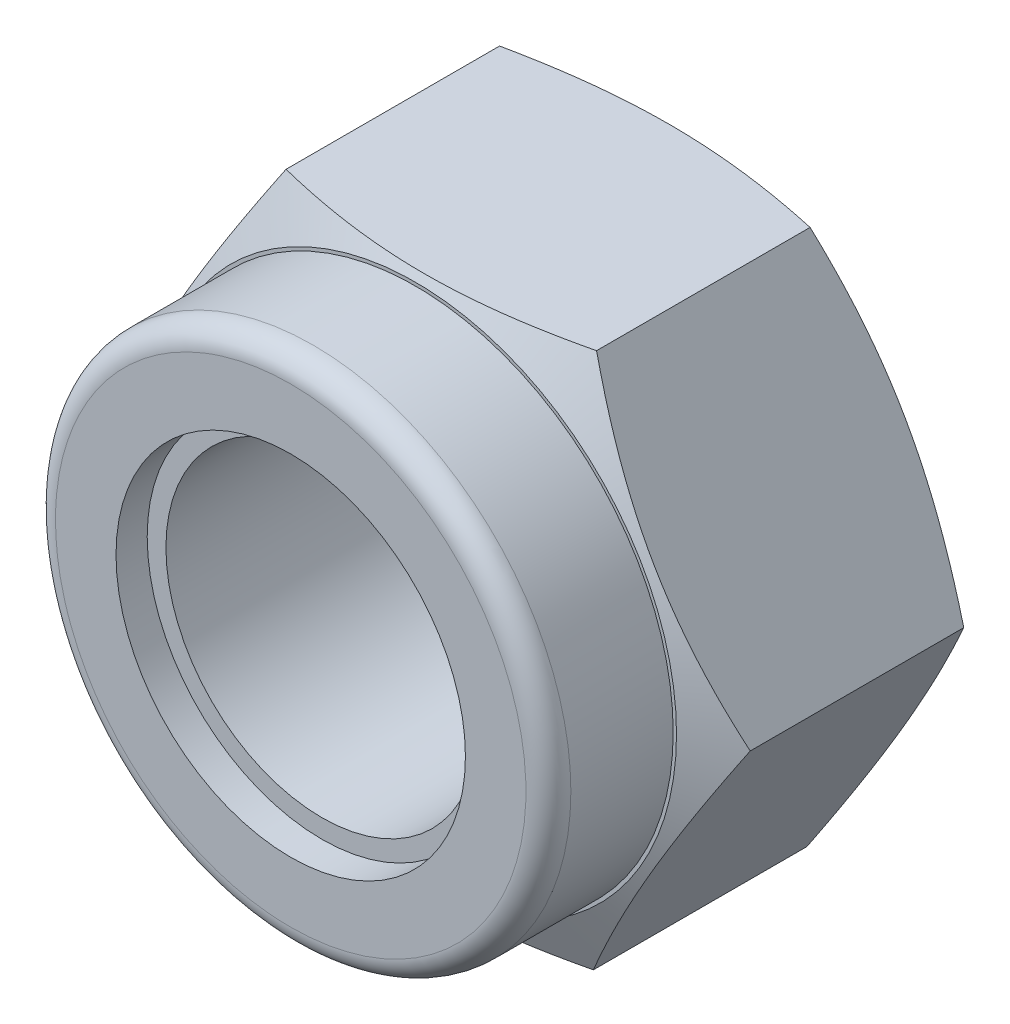
ISO-10303-21;
HEADER;
FILE_DESCRIPTION(('STEP AP214'),'2;1');
FILE_NAME('part.step','',(''),(''),'','','');
FILE_SCHEMA(('AUTOMOTIVE_DESIGN { 1 0 10303 214 1 1 1 1 }'));
ENDSEC;
DATA;
#1=APPLICATION_CONTEXT('core data for automotive mechanical design processes');
#2=APPLICATION_PROTOCOL_DEFINITION('international standard','automotive_design',2000,#1);
#3=PRODUCT_CONTEXT('',#1,'mechanical');
#4=PRODUCT('Part','Part','',(#3));
#5=PRODUCT_RELATED_PRODUCT_CATEGORY('part','',(#4));
#6=PRODUCT_DEFINITION_FORMATION('','',#4);
#7=PRODUCT_DEFINITION_CONTEXT('part definition',#1,'design');
#8=PRODUCT_DEFINITION('design','',#6,#7);
#9=PRODUCT_DEFINITION_SHAPE('','',#8);
#10=(LENGTH_UNIT() NAMED_UNIT(*) SI_UNIT(.MILLI.,.METRE.));
#11=(NAMED_UNIT(*) PLANE_ANGLE_UNIT() SI_UNIT($,.RADIAN.));
#12=(NAMED_UNIT(*) SI_UNIT($,.STERADIAN.) SOLID_ANGLE_UNIT());
#13=UNCERTAINTY_MEASURE_WITH_UNIT(LENGTH_MEASURE(1.E-05),#10,'distance_accuracy_value','');
#14=(GEOMETRIC_REPRESENTATION_CONTEXT(3) GLOBAL_UNCERTAINTY_ASSIGNED_CONTEXT((#13)) GLOBAL_UNIT_ASSIGNED_CONTEXT((#10,
#11,#12)) REPRESENTATION_CONTEXT('',''));
#15=CARTESIAN_POINT('',(0.,0.,0.));
#16=DIRECTION('',(0.,0.,1.));
#17=DIRECTION('',(1.,0.,0.));
#18=AXIS2_PLACEMENT_3D('',#15,#16,#17);
#19=CARTESIAN_POINT('',(0.,0.,5.334));
#20=DIRECTION('',(0.,0.,1.));
#21=DIRECTION('',(1.,0.,0.));
#22=AXIS2_PLACEMENT_3D('',#19,#20,#21);
#23=PLANE('',#22);
#24=CARTESIAN_POINT('',(0.,0.,5.33400000000736));
#25=DIRECTION('',(0.,0.,-1.));
#26=DIRECTION('',(-1.,0.,0.));
#27=AXIS2_PLACEMENT_3D('',#24,#25,#26);
#28=CIRCLE('',#27,5.31273775635555);
#29=CARTESIAN_POINT('',(-5.31273775635555,0.,5.33400000000736));
#30=VERTEX_POINT('',#29);
#31=EDGE_CURVE('E281',#30,#30,#28,.T.);
#32=ORIENTED_EDGE('',*,*,#31,.F.);
#33=EDGE_LOOP('',(#32));
#34=FACE_BOUND('',#33,.T.);
#35=CARTESIAN_POINT('',(0.,0.,5.334));
#36=DIRECTION('',(0.,0.,1.));
#37=DIRECTION('',(1.,0.,0.));
#38=AXIS2_PLACEMENT_3D('',#35,#36,#37);
#39=CIRCLE('',#38,5.2451);
#40=CARTESIAN_POINT('',(5.2451,0.,5.334));
#41=VERTEX_POINT('',#40);
#42=EDGE_CURVE('E20',#41,#41,#39,.T.);
#43=ORIENTED_EDGE('',*,*,#42,.F.);
#44=EDGE_LOOP('',(#43));
#45=FACE_BOUND('',#44,.T.);
#46=ADVANCED_FACE('F16',(#34,#45),#23,.T.);
#47=CARTESIAN_POINT('',(0.,0.,5.334));
#48=DIRECTION('',(0.,0.,1.));
#49=DIRECTION('',(1.,0.,0.));
#50=AXIS2_PLACEMENT_3D('',#47,#48,#49);
#51=CYLINDRICAL_SURFACE('',#50,5.2451);
#52=ORIENTED_EDGE('',*,*,#42,.T.);
#53=EDGE_LOOP('',(#52));
#54=FACE_BOUND('',#53,.T.);
#55=CARTESIAN_POINT('',(0.,0.,7.4168));
#56=DIRECTION('',(0.,0.,1.));
#57=DIRECTION('',(1.,0.,0.));
#58=AXIS2_PLACEMENT_3D('',#55,#56,#57);
#59=CIRCLE('',#58,5.2451);
#60=CARTESIAN_POINT('',(5.2451,0.,7.4168));
#61=VERTEX_POINT('',#60);
#62=EDGE_CURVE('E85',#61,#61,#59,.T.);
#63=ORIENTED_EDGE('',*,*,#62,.F.);
#64=EDGE_LOOP('',(#63));
#65=FACE_BOUND('',#64,.T.);
#66=ADVANCED_FACE('F118',(#54,#65),#51,.T.);
#67=CARTESIAN_POINT('',(0.,0.,4.83836780344404));
#68=DIRECTION('',(0.,0.,-1.));
#69=DIRECTION('',(-1.,0.,0.));
#70=AXIS2_PLACEMENT_3D('',#67,#68,#69);
#71=CONICAL_SURFACE('',#70,6.3265308160112,1.11607702485432);
#72=CARTESIAN_POINT('',(6.32037506594794,-0.0371655629206129,4.84132386008899));
#73=CARTESIAN_POINT('',(6.22833366151809,-0.19444286281713,4.8858660135372));
#74=CARTESIAN_POINT('',(6.13593989417938,-0.352322268768321,4.92769627799901));
#75=CARTESIAN_POINT('',(5.95043037166558,-0.669314789545201,5.00501655106751));
#76=CARTESIAN_POINT('',(5.85731426499188,-0.828428505000025,5.04050324073664));
#77=CARTESIAN_POINT('',(5.67031652629657,-1.14796404024023,5.10421314817306));
#78=CARTESIAN_POINT('',(5.57643405141017,-1.30838730028498,5.1324267923882));
#79=CARTESIAN_POINT('',(5.38814286869859,-1.63013302977098,5.18062149325364));
#80=CARTESIAN_POINT('',(5.29373425705883,-1.79145533485376,5.20060400767163));
#81=CARTESIAN_POINT('',(5.10662322282933,-2.11118446574603,5.23126731054475));
#82=CARTESIAN_POINT('',(5.01392905247022,-2.26957719041745,5.24214339050006));
#83=CARTESIAN_POINT('',(4.82837594477426,-2.58664418810835,5.25490604687276));
#84=CARTESIAN_POINT('',(4.73551699905818,-2.74531847544599,5.25679215221227));
#85=CARTESIAN_POINT('',(4.54996186341723,-3.06238893842205,5.25150045578435));
#86=CARTESIAN_POINT('',(4.4572656043928,-3.2207852321355,5.24433199570822));
#87=CARTESIAN_POINT('',(4.27216288236742,-3.53708262572682,5.22123078858181));
#88=CARTESIAN_POINT('',(4.17975639476994,-3.69498376763441,5.20529880682979));
#89=CARTESIAN_POINT('',(4.00714250371091,-3.98994066098654,5.16780955551947));
#90=CARTESIAN_POINT('',(3.92688014289494,-4.12709032173596,5.14722700506324));
#91=CARTESIAN_POINT('',(3.76677978044193,-4.40066451234116,5.10035283174324));
#92=CARTESIAN_POINT('',(3.68694180089308,-4.53708900445337,5.0740609146422));
#93=CARTESIAN_POINT('',(3.5269404443261,-4.81049401708344,5.01605322972002));
#94=CARTESIAN_POINT('',(3.44678193376816,-4.94746622195552,4.9842853299852));
#95=CARTESIAN_POINT('',(3.28699660715654,-5.22050208976119,4.91612438552128));
#96=CARTESIAN_POINT('',(3.20736961164292,-5.35656605935,4.87973299465746));
#97=CARTESIAN_POINT('',(3.12800121134054,-5.49218815001656,4.84132386008874));
#98=B_SPLINE_CURVE_WITH_KNOTS('',3,(#72,#73,#74,#75,#76,#77,#78,#79,#80,#81,#82,#83,#84,#85,#86,
#87,#88,#89,#90,#91,#92,#93,#94,#95,#96,#97),.UNSPECIFIED.,.F.,.F.,(4,2,2,2,2,2,2,2,2,2,2,2,4),
(0.,0.562813868194877,1.12592134237628,1.68976629638556,2.2535113481042,2.80483224896724,
3.35618203892448,3.90696345979255,4.45769678981567,4.93829687717906,5.41892173857439,
5.90440415872453,6.38971340373801),.UNSPECIFIED.);
#99=CARTESIAN_POINT('',(6.3203750659453,-0.0371655629146358,4.8413238600903));
#100=VERTEX_POINT('',#99);
#101=CARTESIAN_POINT('',(3.12800122281629,-5.49218815008425,4.84132385728342));
#102=VERTEX_POINT('',#101);
#103=EDGE_CURVE('E73',#100,#102,#98,.T.);
#104=ORIENTED_EDGE('',*,*,#103,.F.);
#105=CARTESIAN_POINT('',(3.19237385460845,5.45502258709762,4.84132386008864));
#106=CARTESIAN_POINT('',(3.28208512918141,5.29750628008782,4.88563179788484));
#107=CARTESIAN_POINT('',(3.37213784296513,5.13939046935004,4.92725624998518));
#108=CARTESIAN_POINT('',(3.55294266570987,4.82193084006841,5.00423596484944));
#109=CARTESIAN_POINT('',(3.64369510847837,4.66258643542072,5.0395880139036));
#110=CARTESIAN_POINT('',(3.8259485291596,4.34258333768004,5.10311689041716));
#111=CARTESIAN_POINT('',(3.91745035997898,4.18192314704165,5.13128385422299));
#112=CARTESIAN_POINT('',(4.1009666015464,3.85970277077768,5.17948424190754));
#113=CARTESIAN_POINT('',(4.19298092192724,3.69814274382008,5.19951905640176));
#114=CARTESIAN_POINT('',(4.3763064177163,3.3762572816539,5.23055252558859));
#115=CARTESIAN_POINT('',(4.46761329058068,3.21593940091178,5.24165376667182));
#116=CARTESIAN_POINT('',(4.65039373436749,2.89501094865245,5.25477402327016));
#117=CARTESIAN_POINT('',(4.74186731391235,2.73440036199585,5.25679255485539));
#118=CARTESIAN_POINT('',(4.92465602509764,2.41345739372297,5.25166678488675));
#119=CARTESIAN_POINT('',(5.01597122281918,2.25312489608054,5.24453194191376));
#120=CARTESIAN_POINT('',(5.19831553759308,1.93296220522435,5.2214010893566));
#121=CARTESIAN_POINT('',(5.2893446796386,1.77313196812721,5.20540587686116));
#122=CARTESIAN_POINT('',(5.45755507746106,1.47778580576614,5.16812128791714));
#123=CARTESIAN_POINT('',(5.53479875100708,1.34216028651277,5.14796055986878));
#124=CARTESIAN_POINT('',(5.68888070460646,1.07162104355403,5.10212452056477));
#125=CARTESIAN_POINT('',(5.76571899315048,0.936707304940669,5.07644932528127));
#126=CARTESIAN_POINT('',(5.91894129525481,0.667677450065663,5.02012897810935));
#127=CARTESIAN_POINT('',(5.99532532753603,0.533561300933592,4.98948403252753));
#128=CARTESIAN_POINT('',(6.14762095713527,0.266158510566403,4.9237807036753));
#129=CARTESIAN_POINT('',(6.22353258486393,0.13287181593588,4.88872260764732));
#130=CARTESIAN_POINT('',(6.30626569398043,-0.0123921308479018,4.84827518686258));
#131=CARTESIAN_POINT('',(6.31332140864244,-0.0247806530505442,4.84480784669621));
#132=CARTESIAN_POINT('',(6.32037506594266,-0.0371655629086588,4.84132386009161));
#133=B_SPLINE_CURVE_WITH_KNOTS('',3,(#105,#106,#107,#108,#109,#110,#111,#112,#113,#114,#115,
#116,#117,#118,#119,#120,#121,#122,#123,#124,#125,#126,#127,#128,#129,#130,#131,#132),
.UNSPECIFIED.,.F.,.F.,(4,2,2,2,2,2,2,2,2,2,2,2,2,4),(0.,0.55985412939021,1.11999428081796,
1.68089930141867,2.24170836557184,2.79598175912566,3.35028468420697,3.90401528500992,
4.45769607967872,4.92972204239881,5.4017380791355,5.87373452633379,6.34570026817044,
6.38971758818025),.UNSPECIFIED.);
#134=CARTESIAN_POINT('',(3.19237385707062,5.45502258277493,4.8413238613046));
#135=VERTEX_POINT('',#134);
#136=EDGE_CURVE('E126',#135,#100,#133,.T.);
#137=ORIENTED_EDGE('',*,*,#136,.F.);
#138=CARTESIAN_POINT('',(-3.12800121134198,5.49218815001699,4.84132386008821));
#139=CARTESIAN_POINT('',(-2.94577437197797,5.49111660552899,4.88586601353647));
#140=CARTESIAN_POINT('',(-2.76284991202042,5.49004095883792,4.92769627799833));
#141=CARTESIAN_POINT('',(-2.39557157496093,5.48788126008548,5.00501655106693));
#142=CARTESIAN_POINT('',(-2.21121700194961,5.48679720393198,5.04050324073611));
#143=CARTESIAN_POINT('',(-1.84099224167192,5.48462017939169,5.10421314817263));
#144=CARTESIAN_POINT('',(-1.65512038567198,5.48352720119229,5.13242679238782));
#145=CARTESIAN_POINT('',(-1.28233481902201,5.48133511839845,5.18062149325336));
#146=CARTESIAN_POINT('',(-1.09542129880329,5.48023601492378,5.2006040076714));
#147=CARTESIAN_POINT('',(-0.724972232005771,5.47805767139879,5.2312673105446));
#148=CARTESIAN_POINT('',(-0.541453023486053,5.47697852742078,5.24214339049995));
#149=CARTESIAN_POINT('',(-0.174088394935942,5.47481832125039,5.25490604687272));
#150=CARTESIAN_POINT('',(0.00975704168396752,5.47373725896044,5.25679215221226));
#151=CARTESIAN_POINT('',(0.37712568523155,5.47157702918074,5.25150045578441));
#152=CARTESIAN_POINT('',(0.560649028964985,5.47049786088653,5.2443319957083));
#153=CARTESIAN_POINT('',(0.927121967978725,5.46834289809856,5.22123078858194));
#154=CARTESIAN_POINT('',(1.11007161195609,5.46726710331844,5.20529880682994));
#155=CARTESIAN_POINT('',(1.45181872015016,5.4652575352913,5.16780955551962));
#156=CARTESIAN_POINT('',(1.61072499088775,5.46432312223167,5.14722700506338));
#157=CARTESIAN_POINT('',(1.92769737099852,5.46245923649487,5.10035283174334));
#158=CARTESIAN_POINT('',(2.08576343664071,5.46152976407484,5.07406091464228));
#159=CARTESIAN_POINT('',(2.40253980138424,5.4596670309629,5.01605322972003));
#160=CARTESIAN_POINT('',(2.56124046569499,5.45873382692624,4.98428532998516));
#161=CARTESIAN_POINT('',(2.87758912666524,5.45687360883142,4.91612438552116));
#162=CARTESIAN_POINT('',(3.0352374786259,5.45594659268399,4.87973299465728));
#163=CARTESIAN_POINT('',(3.19237385460888,5.45502258709768,4.8413238600885));
#164=B_SPLINE_CURVE_WITH_KNOTS('',3,(#138,#139,#140,#141,#142,#143,#144,#145,#146,#147,#148,
#149,#150,#151,#152,#153,#154,#155,#156,#157,#158,#159,#160,#161,#162,#163),.UNSPECIFIED.,.F.,
.F.,(4,2,2,2,2,2,2,2,2,2,2,2,4),(0.,0.56281386819512,1.12592134237677,1.68976629638629,
2.25351134810518,2.80483224896845,3.35618203892592,3.90696345979422,4.45769678981757,
4.93829687718154,5.41892173857746,5.90440415872821,6.3897134037423),.UNSPECIFIED.);
#165=CARTESIAN_POINT('',(-3.12800122281598,5.49218815008425,4.84132385728349));
#166=VERTEX_POINT('',#165);
#167=EDGE_CURVE('E133',#166,#135,#164,.T.);
#168=ORIENTED_EDGE('',*,*,#167,.F.);
#169=CARTESIAN_POINT('',(-6.32037506594956,0.0371655629178402,4.84132386008821));
#170=CARTESIAN_POINT('',(-6.22833366151967,0.194442862814418,4.88586601353647));
#171=CARTESIAN_POINT('',(-6.13593989418093,0.352322268765671,4.92769627799833));
#172=CARTESIAN_POINT('',(-5.95043037166705,0.669314789542675,5.00501655106693));
#173=CARTESIAN_POINT('',(-5.85731426499332,0.828428504997562,5.04050324073611));
#174=CARTESIAN_POINT('',(-5.67031652629793,1.1479640402379,5.10421314817263));
#175=CARTESIAN_POINT('',(-5.5764340514115,1.30838730028271,5.13242679238782));
#176=CARTESIAN_POINT('',(-5.38814286869984,1.63013302976884,5.18062149325336));
#177=CARTESIAN_POINT('',(-5.29373425706004,1.79145533485169,5.2006040076714));
#178=CARTESIAN_POINT('',(-5.10662322283046,2.11118446574409,5.2312673105446));
#179=CARTESIAN_POINT('',(-5.01392905247131,2.26957719041558,5.24214339049995));
#180=CARTESIAN_POINT('',(-4.82837594477528,2.58664418810661,5.25490604687272));
#181=CARTESIAN_POINT('',(-4.73551699905915,2.74531847544432,5.25679215221226));
#182=CARTESIAN_POINT('',(-4.54996186341813,3.0623889384205,5.25150045578441));
#183=CARTESIAN_POINT('',(-4.45726560439367,3.22078523213402,5.2443319957083));
#184=CARTESIAN_POINT('',(-4.27216288236821,3.53708262572548,5.22123078858194));
#185=CARTESIAN_POINT('',(-4.17975639477069,3.69498376763314,5.20529880682994));
#186=CARTESIAN_POINT('',(-4.00714250371156,3.98994066098543,5.16780955551963));
#187=CARTESIAN_POINT('',(-3.92688014289553,4.12709032173495,5.1472270050634));
#188=CARTESIAN_POINT('',(-3.7667797804424,4.40066451234036,5.10035283174339));
#189=CARTESIAN_POINT('',(-3.68694180089349,4.53708900445266,5.07406091464234));
#190=CARTESIAN_POINT('',(-3.5269404443264,4.81049401708294,5.01605322972014));
#191=CARTESIAN_POINT('',(-3.44678193376839,4.94746622195512,4.98428532998529));
#192=CARTESIAN_POINT('',(-3.28699660715666,5.22050208976099,4.91612438552134));
#193=CARTESIAN_POINT('',(-3.20736961164298,5.3565660593499,4.87973299465749));
#194=CARTESIAN_POINT('',(-3.12800121134054,5.49218815001656,4.84132386008874));
#195=B_SPLINE_CURVE_WITH_KNOTS('',3,(#169,#170,#171,#172,#173,#174,#175,#176,#177,#178,#179,
#180,#181,#182,#183,#184,#185,#186,#187,#188,#189,#190,#191,#192,#193,#194),.UNSPECIFIED.,.F.,
.F.,(4,2,2,2,2,2,2,2,2,2,2,2,4),(0.,0.56281386819512,1.12592134237677,1.6897662963863,
2.25351134810518,2.80483224896845,3.35618203892592,3.90696345979422,4.45769678981757,
4.9382968771813,5.41892173857698,5.90440415872747,6.38971340374132),.UNSPECIFIED.);
#196=CARTESIAN_POINT('',(-6.32037507174721,0.0371655530104973,4.84132385728233));
#197=VERTEX_POINT('',#196);
#198=EDGE_CURVE('E140',#197,#166,#195,.T.);
#199=ORIENTED_EDGE('',*,*,#198,.F.);
#200=CARTESIAN_POINT('',(-3.19237385460758,-5.45502258709915,4.84132386008821));
#201=CARTESIAN_POINT('',(-3.28208512918056,-5.29750628008931,4.88563179788444));
#202=CARTESIAN_POINT('',(-3.3721378429643,-5.13939046935149,4.92725624998481));
#203=CARTESIAN_POINT('',(-3.55294266570909,-4.82193084006978,5.00423596484913));
#204=CARTESIAN_POINT('',(-3.64369510847761,-4.66258643542207,5.03958801390332));
#205=CARTESIAN_POINT('',(-3.82594852915888,-4.34258333768131,5.10311689041693));
#206=CARTESIAN_POINT('',(-3.91745035997828,-4.18192314704288,5.13128385422278));
#207=CARTESIAN_POINT('',(-4.10096660154574,-3.85970277077883,5.17948424190739));
#208=CARTESIAN_POINT('',(-4.19298092192661,-3.69814274382119,5.19951905640164));
#209=CARTESIAN_POINT('',(-4.3763064177157,-3.37625728165494,5.23055252558851));
#210=CARTESIAN_POINT('',(-4.4676132905801,-3.21593940091279,5.24165376667176));
#211=CARTESIAN_POINT('',(-4.65039373436695,-2.89501094865339,5.25477402327014));
#212=CARTESIAN_POINT('',(-4.74186731391183,-2.73440036199675,5.25679255485539));
#213=CARTESIAN_POINT('',(-4.92465602509716,-2.41345739372381,5.25166678488678));
#214=CARTESIAN_POINT('',(-5.01597122281873,-2.25312489608134,5.2445319419138));
#215=CARTESIAN_POINT('',(-5.19831553759266,-1.93296220522508,5.22140108935667));
#216=CARTESIAN_POINT('',(-5.28934467963821,-1.77313196812791,5.20540587686124));
#217=CARTESIAN_POINT('',(-5.45755507746104,-1.47778580576617,5.16812128791715));
#218=CARTESIAN_POINT('',(-5.53479875100741,-1.34216028651217,5.1479605598687));
#219=CARTESIAN_POINT('',(-5.68888070460751,-1.0716210435522,5.10212452056444));
#220=CARTESIAN_POINT('',(-5.76571899315188,-0.936707304938216,5.07644932528079));
#221=CARTESIAN_POINT('',(-5.91894129525691,-0.667677450061981,5.02012897810854));
#222=CARTESIAN_POINT('',(-5.99532532753847,-0.5335613009293,4.98948403252653));
#223=CARTESIAN_POINT('',(-6.14762095713841,-0.266158510560896,4.92378070367389));
#224=CARTESIAN_POINT('',(-6.2235325848674,-0.132871815929769,4.88872260764569));
#225=CARTESIAN_POINT('',(-6.3062656939849,0.0123921308557474,4.84827518686039));
#226=CARTESIAN_POINT('',(-6.31332140864756,0.0247806530595255,4.84480784669369));
#227=CARTESIAN_POINT('',(-6.32037506594842,0.0371655629187751,4.84132386008877));
#228=B_SPLINE_CURVE_WITH_KNOTS('',3,(#200,#201,#202,#203,#204,#205,#206,#207,#208,#209,#210,
#211,#212,#213,#214,#215,#216,#217,#218,#219,#220,#221,#222,#223,#224,#225,#226,#227),
.UNSPECIFIED.,.F.,.F.,(4,2,2,2,2,2,2,2,2,2,2,2,2,4),(0.,0.559854129390351,1.11999428081824,
1.6808993014191,2.24170836557241,2.79598175912635,3.35028468420777,3.90401528501084,
4.45769607967976,4.92972204240202,5.40173807914089,5.87373452634136,6.34570026818019,
6.38971758819405),.UNSPECIFIED.);
#229=CARTESIAN_POINT('',(-3.19237384892808,-5.45502259707088,4.84132385728312));
#230=VERTEX_POINT('',#229);
#231=EDGE_CURVE('E93',#230,#197,#228,.T.);
#232=ORIENTED_EDGE('',*,*,#231,.F.);
#233=CARTESIAN_POINT('',(3.12800121134198,-5.49218815001699,4.84132386008821));
#234=CARTESIAN_POINT('',(2.94577437197798,-5.491116605529,4.88586601353647));
#235=CARTESIAN_POINT('',(2.76284991202042,-5.49004095883792,4.92769627799833));
#236=CARTESIAN_POINT('',(2.39557157496093,-5.48788126008548,5.00501655106693));
#237=CARTESIAN_POINT('',(2.21121700194961,-5.48679720393198,5.04050324073611));
#238=CARTESIAN_POINT('',(1.84099224167193,-5.48462017939169,5.10421314817263));
#239=CARTESIAN_POINT('',(1.65512038567198,-5.4835272011923,5.13242679238782));
#240=CARTESIAN_POINT('',(1.28233481902201,-5.48133511839845,5.18062149325336));
#241=CARTESIAN_POINT('',(1.09542129880329,-5.48023601492378,5.20060400767139));
#242=CARTESIAN_POINT('',(0.724972232005771,-5.47805767139879,5.2312673105446));
#243=CARTESIAN_POINT('',(0.541453023486052,-5.47697852742079,5.24214339049995));
#244=CARTESIAN_POINT('',(0.17408839493594,-5.47481832125039,5.25490604687272));
#245=CARTESIAN_POINT('',(-0.0097570416839691,-5.47373725896044,5.25679215221226));
#246=CARTESIAN_POINT('',(-0.377125685231552,-5.47157702918074,5.25150045578441));
#247=CARTESIAN_POINT('',(-0.560649028964987,-5.47049786088653,5.2443319957083));
#248=CARTESIAN_POINT('',(-0.927121967978728,-5.46834289809856,5.22123078858194));
#249=CARTESIAN_POINT('',(-1.11007161195609,-5.46726710331844,5.20529880682994));
#250=CARTESIAN_POINT('',(-1.45181872015008,-5.4652575352913,5.16780955551963));
#251=CARTESIAN_POINT('',(-1.6107249908876,-5.46432312223168,5.1472270050634));
#252=CARTESIAN_POINT('',(-1.92769737099821,-5.46245923649487,5.10035283174339));
#253=CARTESIAN_POINT('',(-2.08576343664031,-5.46152976407484,5.07406091464234));
#254=CARTESIAN_POINT('',(-2.40253980138368,-5.45966703096291,5.01605322972014));
#255=CARTESIAN_POINT('',(-2.56124046569435,-5.45873382692624,4.98428532998529));
#256=CARTESIAN_POINT('',(-2.87758912666444,-5.45687360883142,4.91612438552134));
#257=CARTESIAN_POINT('',(-3.03523747862502,-5.455946592684,4.87973299465749));
#258=CARTESIAN_POINT('',(-3.19237385460793,-5.45502258709769,4.84132386008874));
#259=B_SPLINE_CURVE_WITH_KNOTS('',3,(#233,#234,#235,#236,#237,#238,#239,#240,#241,#242,#243,
#244,#245,#246,#247,#248,#249,#250,#251,#252,#253,#254,#255,#256,#257,#258),.UNSPECIFIED.,.F.,
.F.,(4,2,2,2,2,2,2,2,2,2,2,2,4),(0.,0.56281386819512,1.12592134237677,1.68976629638629,
2.25351134810518,2.80483224896845,3.35618203892592,3.90696345979422,4.45769678981757,
4.9382968771813,5.41892173857698,5.90440415872747,6.38971340374131),.UNSPECIFIED.);
#260=EDGE_CURVE('E84',#102,#230,#259,.T.);
#261=ORIENTED_EDGE('',*,*,#260,.F.);
#262=EDGE_LOOP('',(#104,#137,#168,#199,#232,#261));
#263=FACE_BOUND('',#262,.T.);
#264=ORIENTED_EDGE('',*,*,#31,.T.);
#265=EDGE_LOOP('',(#264));
#266=FACE_BOUND('',#265,.T.);
#267=ADVANCED_FACE('F95',(#263,#266),#71,.T.);
#268=CARTESIAN_POINT('',(0.,0.,7.4168));
#269=DIRECTION('',(0.,0.,-1.));
#270=DIRECTION('',(-1.,0.,0.));
#271=AXIS2_PLACEMENT_3D('',#268,#269,#270);
#272=TOROIDAL_SURFACE('',#271,4.7879,0.4572);
#273=ORIENTED_EDGE('',*,*,#62,.T.);
#274=EDGE_LOOP('',(#273));
#275=FACE_BOUND('',#274,.T.);
#276=CARTESIAN_POINT('',(0.,4.7879,7.874));
#277=CARTESIAN_POINT('',(-0.912507970637655,4.78800107826667,7.874));
#278=CARTESIAN_POINT('',(-1.7624006599113,4.45173340665681,7.874));
#279=CARTESIAN_POINT('',(-2.21282144880202,4.27352037831036,7.874));
#280=CARTESIAN_POINT('',(-2.61998557823273,4.00745080816378,7.874));
#281=CARTESIAN_POINT('',(-3.03415135893962,3.73680586850226,7.874));
#282=CARTESIAN_POINT('',(-3.38555655764307,3.38555655764307,7.874));
#283=CARTESIAN_POINT('',(-3.73546696528567,3.03580137473629,7.874));
#284=CARTESIAN_POINT('',(-4.00745080816377,2.61998557823273,7.874));
#285=CARTESIAN_POINT('',(-4.27255727958396,2.21468408162421,7.874));
#286=CARTESIAN_POINT('',(-4.4517334066568,1.7624006599113,7.874));
#287=CARTESIAN_POINT('',(-4.78770071533789,0.9143387755723,7.874));
#288=CARTESIAN_POINT('',(-4.7879,0.,7.874));
#289=CARTESIAN_POINT('',(-4.78809883178006,-0.912260905566992,7.874));
#290=CARTESIAN_POINT('',(-4.4517334066568,-1.7624006599113,7.874));
#291=CARTESIAN_POINT('',(-4.27352037830815,-2.21282144880707,7.874));
#292=CARTESIAN_POINT('',(-4.00745080816377,-2.61998557823274,7.874));
#293=CARTESIAN_POINT('',(-3.7368058684979,-3.03415135894459,7.874));
#294=CARTESIAN_POINT('',(-3.38555655764306,-3.38555655764308,7.874));
#295=CARTESIAN_POINT('',(-3.03580137473736,-3.73546696528398,7.874));
#296=CARTESIAN_POINT('',(-2.61998557823271,-4.00745080816379,7.874));
#297=CARTESIAN_POINT('',(-2.214684081631,-4.27255727958048,7.874));
#298=CARTESIAN_POINT('',(-1.76240065991129,-4.45173340665681,7.874));
#299=CARTESIAN_POINT('',(-0.914091321852844,-4.78779874634594,7.874));
#300=CARTESIAN_POINT('',(0.,-4.7879,7.874));
#301=B_SPLINE_CURVE_WITH_KNOTS('',2,(#276,#277,#278,#279,#280,#281,#282,#283,#284,#285,#286,
#287,#288,#289,#290,#291,#292,#293,#294,#295,#296,#297,#298,#299,#300),.UNSPECIFIED.,.F.,.F.,(3,
2,2,2,2,2,2,2,2,2,2,2,3),(0.,0.125,0.1875,0.25,0.3125,0.375,0.5,0.625,0.6875,0.75,0.8125,0.875,
1.),.UNSPECIFIED.);
#302=CARTESIAN_POINT('',(0.,4.7879,7.874));
#303=VERTEX_POINT('',#302);
#304=CARTESIAN_POINT('',(0.,-4.7879,7.874));
#305=VERTEX_POINT('',#304);
#306=EDGE_CURVE('E261',#303,#305,#301,.T.);
#307=ORIENTED_EDGE('',*,*,#306,.F.);
#308=CARTESIAN_POINT('',(0.,0.,7.874));
#309=DIRECTION('',(0.,0.,-1.));
#310=DIRECTION('',(-1.,0.,0.));
#311=AXIS2_PLACEMENT_3D('',#308,#309,#310);
#312=CIRCLE('',#311,4.7879);
#313=EDGE_CURVE('E262',#305,#303,#312,.F.);
#314=ORIENTED_EDGE('',*,*,#313,.F.);
#315=EDGE_LOOP('',(#307,#314));
#316=FACE_BOUND('',#315,.T.);
#317=ADVANCED_FACE('F18',(#275,#316),#272,.T.);
#318=CARTESIAN_POINT('',(6.32037506594871,-0.0371655629192953,0.));
#319=DIRECTION('',(0.863070343395602,-0.505083737959358,0.));
#320=DIRECTION('',(0.505083737959358,0.863070343395602,0.));
#321=AXIS2_PLACEMENT_3D('',#318,#319,#320);
#322=PLANE('',#321);
#323=CARTESIAN_POINT('',(6.32037502985006,-0.0371654459643939,0.49495993962358));
#324=CARTESIAN_POINT('',(6.21595254922659,-0.215599232787237,0.450368281543948));
#325=CARTESIAN_POINT('',(6.11116742702291,-0.394652622018415,0.408901016145712));
#326=CARTESIAN_POINT('',(5.90086249945405,-0.754014743171803,0.333349470541661));
#327=CARTESIAN_POINT('',(5.79534231202103,-0.934324127925177,0.299269380046743));
#328=CARTESIAN_POINT('',(5.5836463007788,-1.29606324310159,0.239671060506125));
#329=CARTESIAN_POINT('',(5.47747030068677,-1.47749327475536,0.214155245517185));
#330=CARTESIAN_POINT('',(5.26465625223767,-1.84114286653184,0.172749422188399));
#331=CARTESIAN_POINT('',(5.1580183031682,-2.02336225699609,0.156857439621324));
#332=CARTESIAN_POINT('',(4.9464654976336,-2.38485667558204,0.135632320851297));
#333=CARTESIAN_POINT('',(4.84155560760613,-2.56412321719835,0.130107740976537));
#334=CARTESIAN_POINT('',(4.6317176050926,-2.9226874380652,0.129300758661452));
#335=CARTESIAN_POINT('',(4.52678949183353,-3.10198511863662,0.13401911056459));
#336=CARTESIAN_POINT('',(4.31725526842711,-3.46003025161962,0.153463378695621));
#337=CARTESIAN_POINT('',(4.21264897279512,-3.63877802098118,0.168181601635434));
#338=CARTESIAN_POINT('',(4.00389207635088,-3.99549488348476,0.206949810762892));
#339=CARTESIAN_POINT('',(3.89974143292936,-4.1734640494361,0.230998904680507));
#340=CARTESIAN_POINT('',(3.74000861238008,-4.44641019662172,0.274420805207881));
#341=CARTESIAN_POINT('',(3.68421435964086,-4.54174956562599,0.290822311011308));
#342=CARTESIAN_POINT('',(3.57281346288463,-4.73210772407037,0.325876668715684));
#343=CARTESIAN_POINT('',(3.51720679518185,-4.82712655398393,0.344529224541546));
#344=CARTESIAN_POINT('',(3.40588754576298,-5.01734519616513,0.384021503684979));
#345=CARTESIAN_POINT('',(3.35017597495109,-5.11254328103321,0.404872337132735));
#346=CARTESIAN_POINT('',(3.23894418645349,-5.3026124728924,0.448508257005031));
#347=CARTESIAN_POINT('',(3.18342397536334,-5.39748356861324,0.471293409419105));
#348=CARTESIAN_POINT('',(3.12800127426777,-5.49218804248861,0.494959830355336));
#349=B_SPLINE_CURVE_WITH_KNOTS('',3,(#323,#324,#325,#326,#327,#328,#329,#330,#331,#332,#333,
#334,#335,#336,#337,#338,#339,#340,#341,#342,#343,#344,#345,#346,#347,#348),.UNSPECIFIED.,.F.,
.F.,(4,2,2,2,2,2,2,2,2,2,2,2,4),(0.,0.634532172801817,1.26942329071488,1.90449321868397,
2.53943282461717,3.16252769933765,3.78566846360438,4.40833036358988,5.03093273583368,
5.36594211654617,5.70090748222071,6.03765525293353,6.374414516459),.UNSPECIFIED.);
#350=CARTESIAN_POINT('',(6.32037501295764,-0.0371654698768281,0.494959834132793));
#351=VERTEX_POINT('',#350);
#352=CARTESIAN_POINT('',(3.1280012542799,-5.49218809632028,0.494959846266548));
#353=VERTEX_POINT('',#352);
#354=EDGE_CURVE('E187',#351,#353,#349,.T.);
#355=ORIENTED_EDGE('',*,*,#354,.F.);
#356=DIRECTION('',(0.,0.,1.));
#357=VECTOR('',#356,1.);
#358=CARTESIAN_POINT('',(6.32037506594758,-0.0371655629173,0.));
#359=LINE('',#358,#357);
#360=EDGE_CURVE('E80',#100,#351,#359,.F.);
#361=ORIENTED_EDGE('',*,*,#360,.F.);
#362=ORIENTED_EDGE('',*,*,#103,.T.);
#363=DIRECTION('',(0.,0.,1.));
#364=VECTOR('',#363,1.);
#365=CARTESIAN_POINT('',(3.12800123429203,-5.49218815015194,0.));
#366=LINE('',#365,#364);
#367=EDGE_CURVE('E77',#353,#102,#366,.T.);
#368=ORIENTED_EDGE('',*,*,#367,.F.);
#369=EDGE_LOOP('',(#355,#361,#362,#368));
#370=FACE_BOUND('',#369,.T.);
#371=ADVANCED_FACE('F76',(#370),#322,.T.);
#372=CARTESIAN_POINT('',(3.1280012113403,-5.49218815001698,0.));
#373=DIRECTION('',(-0.00588017641340522,-0.999982711613229,0.));
#374=DIRECTION('',(0.999982711613229,-0.00588017641340522,0.));
#375=AXIS2_PLACEMENT_3D('',#372,#373,#374);
#376=PLANE('',#375);
#377=CARTESIAN_POINT('',(3.12800126410636,-5.49218810135755,0.494959903583258));
#378=CARTESIAN_POINT('',(2.92126182811703,-5.49097244736428,0.450368264032376));
#379=CARTESIAN_POINT('',(2.71380448194717,-5.48975255335621,0.408901006496991));
#380=CARTESIAN_POINT('',(2.2974352910039,-5.48730419616397,0.333349467211875));
#381=CARTESIAN_POINT('',(2.08852268982816,-5.48607572852271,0.299269375173549));
#382=CARTESIAN_POINT('',(1.66939942080633,-5.48361116462506,0.239671055115595));
#383=CARTESIAN_POINT('',(1.45918840394405,-5.4823750663176,0.214155241161649));
#384=CARTESIAN_POINT('',(1.03785159459438,-5.4798974893929,0.172749419305434));
#385=CARTESIAN_POINT('',(0.826725998679609,-5.4786560119318,0.156857437172842));
#386=CARTESIAN_POINT('',(0.407886245447399,-5.47619311753625,0.135632319477446));
#387=CARTESIAN_POINT('',(0.20018192087746,-5.47497175841521,0.13010774025241));
#388=CARTESIAN_POINT('',(-0.215262805473554,-5.4725288279472,0.129300759234597));
#389=CARTESIAN_POINT('',(-0.423003208785049,-5.47130725659122,0.134019111787272));
#390=CARTESIAN_POINT('',(-0.837846502185645,-5.46886786265628,0.153463381242832));
#391=CARTESIAN_POINT('',(-1.04494975950399,-5.46765003791789,0.168181604854153));
#392=CARTESIAN_POINT('',(-1.45825407330196,-5.46521969362693,0.206949815300636));
#393=CARTESIAN_POINT('',(-1.66445521414101,-5.46400717357829,0.230998909865133));
#394=CARTESIAN_POINT('',(-1.98069991851997,-5.46214756677665,0.274420810848493));
#395=CARTESIAN_POINT('',(-2.09116335689859,-5.4614980110421,0.290822316393682));
#396=CARTESIAN_POINT('',(-2.31171879927797,-5.46020108371029,0.325876673424192));
#397=CARTESIAN_POINT('',(-2.42181085017261,-5.45955371183726,0.34452922883462));
#398=CARTESIAN_POINT('',(-2.6422046442367,-5.45825773504237,0.384021506992917));
#399=CARTESIAN_POINT('',(-2.75250438598245,-5.45760914188943,0.404872339869208));
#400=CARTESIAN_POINT('',(-2.97272502177834,-5.45631418331335,0.448508258467606));
#401=CARTESIAN_POINT('',(-3.08264590277041,-5.45566781796699,0.471293410179089));
#402=CARTESIAN_POINT('',(-3.19237373002677,-5.45502258783026,0.494959830356283));
#403=B_SPLINE_CURVE_WITH_KNOTS('',3,(#377,#378,#379,#380,#381,#382,#383,#384,#385,#386,#387,
#388,#389,#390,#391,#392,#393,#394,#395,#396,#397,#398,#399,#400,#401,#402),.UNSPECIFIED.,.F.,
.F.,(4,2,2,2,2,2,2,2,2,2,2,2,4),(0.,0.634532172385119,1.26942329037947,1.90449321903655,
2.53943282544507,3.16252770149619,3.78566846721456,4.4083303684351,5.03093274187141,
5.36594211199886,5.70090746711567,6.03765522705414,6.37441447977782),.UNSPECIFIED.);
#404=CARTESIAN_POINT('',(-3.1923737866375,-5.45502259743716,0.494959846267283));
#405=VERTEX_POINT('',#404);
#406=EDGE_CURVE('E92',#353,#405,#403,.T.);
#407=ORIENTED_EDGE('',*,*,#406,.F.);
#408=ORIENTED_EDGE('',*,*,#367,.T.);
#409=ORIENTED_EDGE('',*,*,#260,.T.);
#410=DIRECTION('',(0.,0.,1.));
#411=VECTOR('',#410,1.);
#412=CARTESIAN_POINT('',(-3.19237384324823,-5.45502260704406,0.));
#413=LINE('',#412,#411);
#414=EDGE_CURVE('E279',#405,#230,#413,.T.);
#415=ORIENTED_EDGE('',*,*,#414,.F.);
#416=EDGE_LOOP('',(#407,#408,#409,#415));
#417=FACE_BOUND('',#416,.T.);
#418=ADVANCED_FACE('F89',(#417),#376,.T.);
#419=CARTESIAN_POINT('',(-3.19237385460841,-5.45502258709769,0.));
#420=DIRECTION('',(-0.868950519809008,-0.494898973653871,0.));
#421=DIRECTION('',(0.494898973653871,-0.868950519809008,0.));
#422=AXIS2_PLACEMENT_3D('',#419,#420,#421);
#423=PLANE('',#422);
#424=CARTESIAN_POINT('',(-3.19237378608869,-5.45502260846171,0.494959903581125));
#425=CARTESIAN_POINT('',(-3.29431095817488,-5.27603996349761,0.450533858379517));
#426=CARTESIAN_POINT('',(-3.39660059519764,-5.09643841829634,0.409208989268028));
#427=CARTESIAN_POINT('',(-3.60189397842345,-4.73598145206156,0.333883437191058));
#428=CARTESIAN_POINT('',(-3.70489809154293,-4.55512538677263,0.29988685758606));
#429=CARTESIAN_POINT('',(-3.91155385066686,-4.19227631776945,0.240380894409588));
#430=CARTESIAN_POINT('',(-4.01520572209591,-4.01028291825484,0.214874654841236));
#431=CARTESIAN_POINT('',(-4.22296106586566,-3.64550318967372,0.173407688495263));
#432=CARTESIAN_POINT('',(-4.32706444324085,-3.46271702734947,0.157445043982262));
#433=CARTESIAN_POINT('',(-4.53435047366295,-3.09876132395802,0.135919089946519));
#434=CARTESIAN_POINT('',(-4.63753012710866,-2.91759704962522,0.130239533722684));
#435=CARTESIAN_POINT('',(-4.84391029342669,-2.55523187552015,0.129199944281238));
#436=CARTESIAN_POINT('',(-4.94711080728035,-2.37403097402479,0.133840679896716));
#437=CARTESIAN_POINT('',(-5.15319218758739,-2.01219041244224,0.153208661890227));
#438=CARTESIAN_POINT('',(-5.25607324443917,-1.83155041805085,0.167927788331837));
#439=CARTESIAN_POINT('',(-5.46138602701545,-1.47105937111545,0.206770820952582));
#440=CARTESIAN_POINT('',(-5.56381779576026,-1.29120824303579,0.230893805893423));
#441=CARTESIAN_POINT('',(-5.7190653442773,-1.01862243226427,0.273964940185001));
#442=CARTESIAN_POINT('',(-5.77209630081474,-0.925509939205661,0.289838994263521));
#443=CARTESIAN_POINT('',(-5.8779866121587,-0.739586253800447,0.323710386390241));
#444=CARTESIAN_POINT('',(-5.93084598497027,-0.646775029840328,0.341707493735086));
#445=CARTESIAN_POINT('',(-6.03639219271878,-0.461455526326656,0.379671579372275));
#446=CARTESIAN_POINT('',(-6.08907902165469,-0.368947257309796,0.399638625442373));
#447=CARTESIAN_POINT('',(-6.1942761469963,-0.184240677554524,0.441387129004676));
#448=CARTESIAN_POINT('',(-6.24678644408668,-0.0920423656139518,0.463168579451298));
#449=CARTESIAN_POINT('',(-6.30626524593391,0.0123913441615718,0.488826135008085));
#450=CARTESIAN_POINT('',(-6.31332095805282,0.0247798618990112,0.491885549052196));
#451=CARTESIAN_POINT('',(-6.32037505882868,0.0371655504178443,0.494959854124256));
#452=B_SPLINE_CURVE_WITH_KNOTS('',3,(#424,#425,#426,#427,#428,#429,#430,#431,#432,#433,#434,
#435,#436,#437,#438,#439,#440,#441,#442,#443,#444,#445,#446,#447,#448,#449,#450,#451),
.UNSPECIFIED.,.F.,.F.,(4,2,2,2,2,2,2,2,2,2,2,2,2,4),(0.,0.632176386040315,1.26470583507634,
1.89746925212574,2.5301054759119,3.15554422197519,3.78102956304947,4.40601155647972,
5.0309323396401,5.35588834516234,5.68080907154056,6.00574098104955,6.33067162886182,
6.37441591397069),.UNSPECIFIED.);
#453=CARTESIAN_POINT('',(-6.32037506818751,0.0371655467603267,0.494959858148727));
#454=VERTEX_POINT('',#453);
#455=EDGE_CURVE('E192',#405,#454,#452,.T.);
#456=ORIENTED_EDGE('',*,*,#455,.F.);
#457=ORIENTED_EDGE('',*,*,#414,.T.);
#458=ORIENTED_EDGE('',*,*,#231,.T.);
#459=DIRECTION('',(0.,0.,1.));
#460=VECTOR('',#459,1.);
#461=CARTESIAN_POINT('',(-6.32037507754601,0.0371655431022195,0.));
#462=LINE('',#461,#460);
#463=EDGE_CURVE('E139',#454,#197,#462,.T.);
#464=ORIENTED_EDGE('',*,*,#463,.F.);
#465=EDGE_LOOP('',(#456,#457,#458,#464));
#466=FACE_BOUND('',#465,.T.);
#467=ADVANCED_FACE('F199',(#466),#423,.T.);
#468=CARTESIAN_POINT('',(-6.32037506594871,0.0371655629192914,0.));
#469=DIRECTION('',(-0.863070343395602,0.505083737959358,0.));
#470=DIRECTION('',(-0.505083737959358,-0.863070343395602,0.));
#471=AXIS2_PLACEMENT_3D('',#468,#469,#470);
#472=PLANE('',#471);
#473=CARTESIAN_POINT('',(-6.32037507081462,0.0371655521408976,0.494959860650831));
#474=CARTESIAN_POINT('',(-6.21595253718308,0.215599316651127,0.450368242624078));
#475=CARTESIAN_POINT('',(-6.11116739330752,0.39465269659167,0.408900994276151));
#476=CARTESIAN_POINT('',(-5.90086244986322,0.754014810939815,0.333349462483797));
#477=CARTESIAN_POINT('',(-5.79534226824115,0.934324198187027,0.299269368751353));
#478=CARTESIAN_POINT('',(-5.58364626100297,1.29606331561824,0.239671048273515));
#479=CARTESIAN_POINT('',(-5.47747025910069,1.47749334703429,0.214155235604035));
#480=CARTESIAN_POINT('',(-5.26465620911973,1.84114293899256,0.172749415617394));
#481=CARTESIAN_POINT('',(-5.15801826032858,2.02336232987557,0.156857434066335));
#482=CARTESIAN_POINT('',(-4.94646545452811,2.38485674955669,0.135632317757613));
#483=CARTESIAN_POINT('',(-4.841555563965,2.56412329185591,0.130107739349354));
#484=CARTESIAN_POINT('',(-4.63171756051101,2.92268751415969,0.12930075994763));
#485=CARTESIAN_POINT('',(-4.52678944684713,3.10198519548513,0.134019113301913));
#486=CARTESIAN_POINT('',(-4.31725522270815,3.46003032976541,0.153463384373127));
#487=CARTESIAN_POINT('',(-4.21264892674821,3.63877809967057,0.168181608794519));
#488=CARTESIAN_POINT('',(-4.00389202970271,3.99549496318964,0.206949820816233));
#489=CARTESIAN_POINT('',(-3.89974138600779,4.17346412961298,0.230998916145158));
#490=CARTESIAN_POINT('',(-3.7400085691363,4.44641027051587,0.27442081765598));
#491=CARTESIAN_POINT('',(-3.6842143203297,4.54174963279977,0.290822322889906));
#492=CARTESIAN_POINT('',(-3.57281343140607,4.73210777785974,0.325876679107955));
#493=CARTESIAN_POINT('',(-3.5172067676033,4.8271266011092,0.34452923401741));
#494=CARTESIAN_POINT('',(-3.40588752603745,5.01734522987151,0.384021510987847));
#495=CARTESIAN_POINT('',(-3.35017595917824,5.11254330798536,0.404872343175146));
#496=CARTESIAN_POINT('',(-3.23894417856852,5.30261248636595,0.448508260237703));
#497=CARTESIAN_POINT('',(-3.18342397141354,5.39748357536249,0.471293411102152));
#498=CARTESIAN_POINT('',(-3.12800127423913,5.49218804253754,0.494959830364238));
#499=B_SPLINE_CURVE_WITH_KNOTS('',3,(#473,#474,#475,#476,#477,#478,#479,#480,#481,#482,#483,
#484,#485,#486,#487,#488,#489,#490,#491,#492,#493,#494,#495,#496,#497,#498),.UNSPECIFIED.,.F.,
.F.,(4,2,2,2,2,2,2,2,2,2,2,2,4),(0.,0.634532171427077,1.26942328903815,1.90449321800705,
2.53943282448176,3.1625277016178,3.78566846856102,4.40833037075881,5.03093274512327,
5.36594210248427,5.7009074448661,6.03765519181169,6.37441443151112),.UNSPECIFIED.);
#500=CARTESIAN_POINT('',(-3.12800125426528,5.49218809634474,0.49495984626927));
#501=VERTEX_POINT('',#500);
#502=EDGE_CURVE('E163',#454,#501,#499,.T.);
#503=ORIENTED_EDGE('',*,*,#502,.F.);
#504=ORIENTED_EDGE('',*,*,#463,.T.);
#505=ORIENTED_EDGE('',*,*,#198,.T.);
#506=DIRECTION('',(0.,0.,1.));
#507=VECTOR('',#506,1.);
#508=CARTESIAN_POINT('',(-3.12800123429142,5.49218815015194,0.));
#509=LINE('',#508,#507);
#510=EDGE_CURVE('E138',#501,#166,#509,.T.);
#511=ORIENTED_EDGE('',*,*,#510,.F.);
#512=EDGE_LOOP('',(#503,#504,#505,#511));
#513=FACE_BOUND('',#512,.T.);
#514=ADVANCED_FACE('F149',(#513),#472,.T.);
#515=CARTESIAN_POINT('',(-3.1280012113403,5.49218815001698,0.));
#516=DIRECTION('',(0.00588017641340505,0.999982711613229,0.));
#517=DIRECTION('',(-0.999982711613229,0.00588017641340505,0.));
#518=AXIS2_PLACEMENT_3D('',#515,#516,#517);
#519=PLANE('',#518);
#520=CARTESIAN_POINT('',(-3.12800126410553,5.49218810138533,0.494959903559902));
#521=CARTESIAN_POINT('',(-2.92126182810276,5.49097244737417,0.450368264019188));
#522=CARTESIAN_POINT('',(-2.71380448192077,5.48975255335873,0.408901006487089));
#523=CARTESIAN_POINT('',(-2.29743529095423,5.487304196161,0.33334946720299));
#524=CARTESIAN_POINT('',(-2.08852268976736,5.48607572852163,0.299269375162396));
#525=CARTESIAN_POINT('',(-1.66939942072583,5.4836111646253,0.239671055103035));
#526=CARTESIAN_POINT('',(-1.459188403855,5.48237506631726,0.214155241149828));
#527=CARTESIAN_POINT('',(-1.03785159448832,5.47989748939208,0.172749419295479));
#528=CARTESIAN_POINT('',(-0.826725998565089,5.47865601193108,0.156857437164014));
#529=CARTESIAN_POINT('',(-0.407886245330905,5.47619311753561,0.135632319472564));
#530=CARTESIAN_POINT('',(-0.200181920767484,5.47497175841458,0.13010774024962));
#531=CARTESIAN_POINT('',(0.215262805570286,5.47252882794662,0.129300759235242));
#532=CARTESIAN_POINT('',(0.423003208875056,5.47130725659069,0.134019111789254));
#533=CARTESIAN_POINT('',(0.837846502263909,5.46886786265582,0.153463381246805));
#534=CARTESIAN_POINT('',(1.04494975957723,5.46765003791746,0.168181604858861));
#535=CARTESIAN_POINT('',(1.45825407336536,5.46521969362655,0.206949815306224));
#536=CARTESIAN_POINT('',(1.66445521419958,5.46400717357795,0.230998909870884));
#537=CARTESIAN_POINT('',(1.98069992251561,5.46214756675315,0.274420811395668));
#538=CARTESIAN_POINT('',(2.09116336482359,5.4614980109955,0.290822317568592));
#539=CARTESIAN_POINT('',(2.31171881503495,5.46020108361763,0.325876676009026));
#540=CARTESIAN_POINT('',(2.42181086983223,5.45955371172166,0.344529232201625));
#541=CARTESIAN_POINT('',(2.64220467171818,5.45825773488077,0.38402151206909));
#542=CARTESIAN_POINT('',(2.75250441738293,5.45760914170479,0.404872345873551));
#543=CARTESIAN_POINT('',(2.97272506098838,5.45631418308278,0.448508266448625));
#544=CARTESIAN_POINT('',(3.082645945871,5.45566781771355,0.471293419208598));
#545=CARTESIAN_POINT('',(3.19237377700431,5.45502258755402,0.494959840485545));
#546=B_SPLINE_CURVE_WITH_KNOTS('',3,(#520,#521,#522,#523,#524,#525,#526,#527,#528,#529,#530,
#531,#532,#533,#534,#535,#536,#537,#538,#539,#540,#541,#542,#543,#544,#545),.UNSPECIFIED.,.F.,
.F.,(4,2,2,2,2,2,2,2,2,2,2,2,4),(0.,0.634532172418991,1.26942329044749,1.90449321912967,
2.53943282556323,3.16252770159465,3.78566846729301,4.40833036849854,5.03093274192114,
5.36594212398316,5.70090749103334,6.03765526304001,6.37441452782923),.UNSPECIFIED.);
#547=CARTESIAN_POINT('',(3.19237381826833,5.4550225830031,0.494959847781789));
#548=VERTEX_POINT('',#547);
#549=EDGE_CURVE('E35',#501,#548,#546,.T.);
#550=ORIENTED_EDGE('',*,*,#549,.F.);
#551=ORIENTED_EDGE('',*,*,#510,.T.);
#552=ORIENTED_EDGE('',*,*,#167,.T.);
#553=DIRECTION('',(0.,0.,1.));
#554=VECTOR('',#553,1.);
#555=CARTESIAN_POINT('',(3.19237385953235,5.45502257845218,0.));
#556=LINE('',#555,#554);
#557=EDGE_CURVE('E259',#548,#135,#556,.T.);
#558=ORIENTED_EDGE('',*,*,#557,.F.);
#559=EDGE_LOOP('',(#550,#551,#552,#558));
#560=FACE_BOUND('',#559,.T.);
#561=ADVANCED_FACE('F145',(#560),#519,.T.);
#562=CARTESIAN_POINT('',(3.19237385460841,5.45502258709769,0.));
#563=DIRECTION('',(0.868950519809008,0.494898973653871,0.));
#564=DIRECTION('',(-0.494898973653871,0.868950519809008,0.));
#565=AXIS2_PLACEMENT_3D('',#562,#563,#564);
#566=PLANE('',#565);
#567=CARTESIAN_POINT('',(3.19237383917959,5.45502261418784,0.494959863948149));
#568=CARTESIAN_POINT('',(3.29431098625198,5.27603994974135,0.450533840510082));
#569=CARTESIAN_POINT('',(3.3966006130897,5.09643839640722,0.409208980500898));
#570=CARTESIAN_POINT('',(3.60189398911898,4.73598142375089,0.333883435465041));
#571=CARTESIAN_POINT('',(3.70489810523491,4.55512536017781,0.299886853799505));
#572=CARTESIAN_POINT('',(3.91155386696281,4.19227629171201,0.240380889557214));
#573=CARTESIAN_POINT('',(4.01520573799879,4.01028289101669,0.214874650994673));
#574=CARTESIAN_POINT('',(4.22296108187621,3.64550316087798,0.173407685968994));
#575=CARTESIAN_POINT('',(4.32706445975176,3.46271699817703,0.157445041766816));
#576=CARTESIAN_POINT('',(4.5343504910956,3.09876129352981,0.135919088629193));
#577=CARTESIAN_POINT('',(4.63753014496616,2.91759701831908,0.130239533007754));
#578=CARTESIAN_POINT('',(4.84391031220918,2.55523184249329,0.129199944809874));
#579=CARTESIAN_POINT('',(4.94711082656299,2.37403094015515,0.133840681068915));
#580=CARTESIAN_POINT('',(5.15319220779118,2.01219037698107,0.153208664426885));
#581=CARTESIAN_POINT('',(5.25607326506407,1.83155038184076,0.167927791585055));
#582=CARTESIAN_POINT('',(5.46138604846334,1.47105933345357,0.206770825656843));
#583=CARTESIAN_POINT('',(5.56381781761006,1.29120820467097,0.2308938113314));
#584=CARTESIAN_POINT('',(5.71906536464795,1.01862239649753,0.273964946158772));
#585=CARTESIAN_POINT('',(5.77209631931586,0.925509906721218,0.289838999951452));
#586=CARTESIAN_POINT('',(5.87798662693601,0.739586227854143,0.323710391342918));
#587=CARTESIAN_POINT('',(5.93084599789328,0.646775007149893,0.341707498238535));
#588=CARTESIAN_POINT('',(6.03639220193677,0.461455510141595,0.379671582827955));
#589=CARTESIAN_POINT('',(6.08907902902199,0.368947244374194,0.399638628299214));
#590=CARTESIAN_POINT('',(6.19427615067357,0.184240671097916,0.441387130525332));
#591=CARTESIAN_POINT('',(6.24678644592462,0.0920423623868665,0.463168580234534));
#592=CARTESIAN_POINT('',(6.30626521296703,-0.0123912862778633,0.48882612078465));
#593=CARTESIAN_POINT('',(6.31332089213138,-0.0247797461532292,0.491885520466767));
#594=CARTESIAN_POINT('',(6.3203749599677,-0.0371653768363562,0.494959811038781));
#595=B_SPLINE_CURVE_WITH_KNOTS('',3,(#567,#568,#569,#570,#571,#572,#573,#574,#575,#576,#577,
#578,#579,#580,#581,#582,#583,#584,#585,#586,#587,#588,#589,#590,#591,#592,#593,#594),
.UNSPECIFIED.,.F.,.F.,(4,2,2,2,2,2,2,2,2,2,2,2,2,4),(0.,0.63217638666909,1.26470583692544,
1.89746925593585,2.53010548143056,3.1555442303356,3.78102957439665,4.40601157054643,
5.03093235637512,5.35588835056447,5.68080906563655,6.00574096379074,6.33067160023507,
6.37441568098563),.UNSPECIFIED.);
#596=EDGE_CURVE('E162',#548,#351,#595,.T.);
#597=ORIENTED_EDGE('',*,*,#596,.F.);
#598=ORIENTED_EDGE('',*,*,#557,.T.);
#599=ORIENTED_EDGE('',*,*,#136,.T.);
#600=ORIENTED_EDGE('',*,*,#360,.T.);
#601=EDGE_LOOP('',(#597,#598,#599,#600));
#602=FACE_BOUND('',#601,.T.);
#603=ADVANCED_FACE('F148',(#602),#566,.T.);
#604=CARTESIAN_POINT('',(0.,0.,7.874));
#605=DIRECTION('',(0.,0.,1.));
#606=DIRECTION('',(1.,0.,0.));
#607=AXIS2_PLACEMENT_3D('',#604,#605,#606);
#608=PLANE('',#607);
#609=CARTESIAN_POINT('',(0.,0.,7.874));
#610=DIRECTION('',(0.,0.,1.));
#611=DIRECTION('',(1.,0.,0.));
#612=AXIS2_PLACEMENT_3D('',#609,#610,#611);
#613=CIRCLE('',#612,3.556);
#614=CARTESIAN_POINT('',(3.556,0.,7.874));
#615=VERTEX_POINT('',#614);
#616=EDGE_CURVE('E250',#615,#615,#613,.F.);
#617=ORIENTED_EDGE('',*,*,#616,.T.);
#618=EDGE_LOOP('',(#617));
#619=FACE_BOUND('',#618,.T.);
#620=ORIENTED_EDGE('',*,*,#313,.T.);
#621=ORIENTED_EDGE('',*,*,#306,.T.);
#622=EDGE_LOOP('',(#620,#621));
#623=FACE_BOUND('',#622,.T.);
#624=ADVANCED_FACE('F178',(#619,#623),#608,.T.);
#625=CARTESIAN_POINT('',(0.,0.,0.497929620706827));
#626=DIRECTION('',(0.,0.,1.));
#627=DIRECTION('',(1.,0.,0.));
#628=AXIS2_PLACEMENT_3D('',#625,#626,#627);
#629=CONICAL_SURFACE('',#628,6.32736878816331,1.16354045370875);
#630=ORIENTED_EDGE('',*,*,#455,.T.);
#631=ORIENTED_EDGE('',*,*,#502,.T.);
#632=ORIENTED_EDGE('',*,*,#549,.T.);
#633=ORIENTED_EDGE('',*,*,#596,.T.);
#634=ORIENTED_EDGE('',*,*,#354,.T.);
#635=ORIENTED_EDGE('',*,*,#406,.T.);
#636=EDGE_LOOP('',(#630,#631,#632,#633,#634,#635));
#637=FACE_BOUND('',#636,.T.);
#638=CARTESIAN_POINT('',(0.,0.,-5.68435272810253E-11));
#639=DIRECTION('',(0.,0.,1.));
#640=DIRECTION('',(1.,0.,0.));
#641=AXIS2_PLACEMENT_3D('',#638,#639,#640);
#642=CIRCLE('',#641,5.17307747395535);
#643=CARTESIAN_POINT('',(5.17307747395535,0.,-5.68435272810253E-11));
#644=VERTEX_POINT('',#643);
#645=EDGE_CURVE('E237',#644,#644,#642,.F.);
#646=ORIENTED_EDGE('',*,*,#645,.F.);
#647=EDGE_LOOP('',(#646));
#648=FACE_BOUND('',#647,.T.);
#649=ADVANCED_FACE('F172',(#637,#648),#629,.T.);
#650=CARTESIAN_POINT('',(0.,0.,7.5565));
#651=DIRECTION('',(0.,0.,1.));
#652=DIRECTION('',(1.,0.,0.));
#653=AXIS2_PLACEMENT_3D('',#650,#651,#652);
#654=CYLINDRICAL_SURFACE('',#653,3.556);
#655=CARTESIAN_POINT('',(0.,0.,7.239));
#656=DIRECTION('',(0.,0.,1.));
#657=DIRECTION('',(1.,0.,0.));
#658=AXIS2_PLACEMENT_3D('',#655,#656,#657);
#659=CIRCLE('',#658,3.556);
#660=CARTESIAN_POINT('',(3.556,0.,7.239));
#661=VERTEX_POINT('',#660);
#662=EDGE_CURVE('E242',#661,#661,#659,.F.);
#663=ORIENTED_EDGE('',*,*,#662,.T.);
#664=EDGE_LOOP('',(#663));
#665=FACE_BOUND('',#664,.T.);
#666=ORIENTED_EDGE('',*,*,#616,.F.);
#667=EDGE_LOOP('',(#666));
#668=FACE_BOUND('',#667,.T.);
#669=ADVANCED_FACE('F177',(#665,#668),#654,.F.);
#670=CARTESIAN_POINT('',(0.,0.,0.));
#671=DIRECTION('',(0.,0.,-1.));
#672=DIRECTION('',(-1.,0.,0.));
#673=AXIS2_PLACEMENT_3D('',#670,#671,#672);
#674=PLANE('',#673);
#675=ORIENTED_EDGE('',*,*,#645,.T.);
#676=EDGE_LOOP('',(#675));
#677=FACE_BOUND('',#676,.T.);
#678=CARTESIAN_POINT('',(0.,0.,0.));
#679=DIRECTION('',(0.,0.,-1.));
#680=DIRECTION('',(-1.,0.,0.));
#681=AXIS2_PLACEMENT_3D('',#678,#679,#680);
#682=CIRCLE('',#681,3.96875000001273);
#683=CARTESIAN_POINT('',(-3.96875000001273,0.,0.));
#684=VERTEX_POINT('',#683);
#685=EDGE_CURVE('E240',#684,#684,#682,.F.);
#686=ORIENTED_EDGE('',*,*,#685,.T.);
#687=EDGE_LOOP('',(#686));
#688=FACE_BOUND('',#687,.T.);
#689=ADVANCED_FACE('F226',(#677,#688),#674,.T.);
#690=CARTESIAN_POINT('',(0.,0.,7.239));
#691=DIRECTION('',(0.,0.,-1.));
#692=DIRECTION('',(-1.,0.,0.));
#693=AXIS2_PLACEMENT_3D('',#690,#691,#692);
#694=PLANE('',#693);
#695=CARTESIAN_POINT('',(0.,0.,7.239));
#696=DIRECTION('',(0.,0.,1.));
#697=DIRECTION('',(1.,0.,0.));
#698=AXIS2_PLACEMENT_3D('',#695,#696,#697);
#699=CIRCLE('',#698,3.175);
#700=CARTESIAN_POINT('',(3.175,0.,7.239));
#701=VERTEX_POINT('',#700);
#702=EDGE_CURVE('E26',#701,#701,#699,.F.);
#703=ORIENTED_EDGE('',*,*,#702,.T.);
#704=EDGE_LOOP('',(#703));
#705=FACE_BOUND('',#704,.T.);
#706=ORIENTED_EDGE('',*,*,#662,.F.);
#707=EDGE_LOOP('',(#706));
#708=FACE_BOUND('',#707,.T.);
#709=ADVANCED_FACE('F219',(#705,#708),#694,.F.);
#710=CARTESIAN_POINT('',(0.,0.,1.13686837721616E-10));
#711=DIRECTION('',(0.,0.,-1.));
#712=DIRECTION('',(-1.,0.,0.));
#713=AXIS2_PLACEMENT_3D('',#710,#711,#712);
#714=CONICAL_SURFACE('',#713,3.96874999989905,0.785398163397448);
#715=CARTESIAN_POINT('',(0.,0.,0.793749999999999));
#716=DIRECTION('',(0.,0.,1.));
#717=DIRECTION('',(1.,0.,0.));
#718=AXIS2_PLACEMENT_3D('',#715,#716,#717);
#719=CIRCLE('',#718,3.175);
#720=CARTESIAN_POINT('',(3.175,0.,0.793749999999999));
#721=VERTEX_POINT('',#720);
#722=EDGE_CURVE('E11',#721,#721,#719,.T.);
#723=ORIENTED_EDGE('',*,*,#722,.T.);
#724=EDGE_LOOP('',(#723));
#725=FACE_BOUND('',#724,.T.);
#726=ORIENTED_EDGE('',*,*,#685,.F.);
#727=EDGE_LOOP('',(#726));
#728=FACE_BOUND('',#727,.T.);
#729=ADVANCED_FACE('F213',(#725,#728),#714,.F.);
#730=CARTESIAN_POINT('',(0.,0.,-11.3464605310747));
#731=DIRECTION('',(0.,0.,1.));
#732=DIRECTION('',(1.,0.,0.));
#733=AXIS2_PLACEMENT_3D('',#730,#731,#732);
#734=CYLINDRICAL_SURFACE('',#733,3.175);
#735=ORIENTED_EDGE('',*,*,#702,.F.);
#736=EDGE_LOOP('',(#735));
#737=FACE_BOUND('',#736,.T.);
#738=ORIENTED_EDGE('',*,*,#722,.F.);
#739=EDGE_LOOP('',(#738));
#740=FACE_BOUND('',#739,.T.);
#741=ADVANCED_FACE('F211',(#737,#740),#734,.F.);
#742=CLOSED_SHELL('',(#46,#66,#267,#317,#371,#418,#467,#514,#561,#603,#624,#649,#669,#689,#709,
#729,#741));
#743=MANIFOLD_SOLID_BREP('B1',#742);
#744=ADVANCED_BREP_SHAPE_REPRESENTATION('',(#18,#743),#14);
#745=SHAPE_DEFINITION_REPRESENTATION(#9,#744);
ENDSEC;
END-ISO-10303-21;
